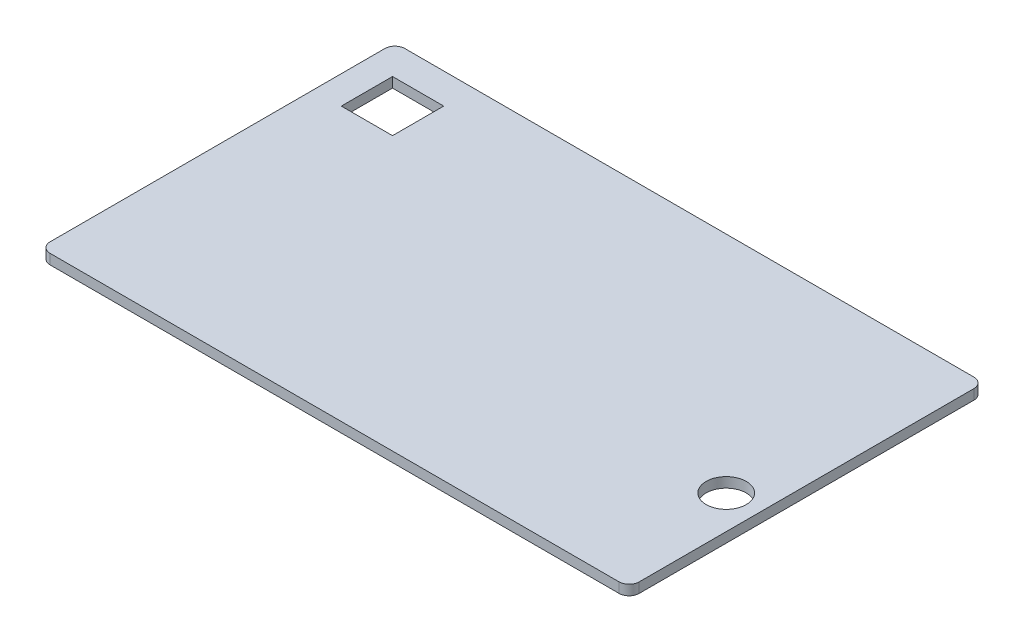
ISO-10303-21;
HEADER;
FILE_DESCRIPTION(('STEP AP214'),'2;1');
FILE_NAME('part.step','',(''),(''),'','','');
FILE_SCHEMA(('AUTOMOTIVE_DESIGN { 1 0 10303 214 1 1 1 1 }'));
ENDSEC;
DATA;
#1=APPLICATION_CONTEXT('core data for automotive mechanical design processes');
#2=APPLICATION_PROTOCOL_DEFINITION('international standard','automotive_design',2000,#1);
#3=PRODUCT_CONTEXT('',#1,'mechanical');
#4=PRODUCT('Part','Part','',(#3));
#5=PRODUCT_RELATED_PRODUCT_CATEGORY('part','',(#4));
#6=PRODUCT_DEFINITION_FORMATION('','',#4);
#7=PRODUCT_DEFINITION_CONTEXT('part definition',#1,'design');
#8=PRODUCT_DEFINITION('design','',#6,#7);
#9=PRODUCT_DEFINITION_SHAPE('','',#8);
#10=(LENGTH_UNIT() NAMED_UNIT(*) SI_UNIT(.MILLI.,.METRE.));
#11=(NAMED_UNIT(*) PLANE_ANGLE_UNIT() SI_UNIT($,.RADIAN.));
#12=(NAMED_UNIT(*) SI_UNIT($,.STERADIAN.) SOLID_ANGLE_UNIT());
#13=UNCERTAINTY_MEASURE_WITH_UNIT(LENGTH_MEASURE(1.E-05),#10,'distance_accuracy_value','');
#14=(GEOMETRIC_REPRESENTATION_CONTEXT(3) GLOBAL_UNCERTAINTY_ASSIGNED_CONTEXT((#13)) GLOBAL_UNIT_ASSIGNED_CONTEXT((#10,
#11,#12)) REPRESENTATION_CONTEXT('',''));
#15=CARTESIAN_POINT('',(0.,0.,0.));
#16=DIRECTION('',(0.,0.,1.));
#17=DIRECTION('',(1.,0.,0.));
#18=AXIS2_PLACEMENT_3D('',#15,#16,#17);
#19=CARTESIAN_POINT('',(88.,3.,53.));
#20=DIRECTION('',(-1.,0.,0.));
#21=DIRECTION('',(0.,0.,1.));
#22=AXIS2_PLACEMENT_3D('',#19,#20,#21);
#23=PLANE('',#22);
#24=DIRECTION('',(0.,0.,-1.));
#25=VECTOR('',#24,1.);
#26=CARTESIAN_POINT('',(88.,0.,53.));
#27=LINE('',#26,#25);
#28=CARTESIAN_POINT('',(88.,0.,50.));
#29=VERTEX_POINT('',#28);
#30=CARTESIAN_POINT('',(88.,0.,-50.));
#31=VERTEX_POINT('',#30);
#32=EDGE_CURVE('E184',#29,#31,#27,.T.);
#33=ORIENTED_EDGE('',*,*,#32,.T.);
#34=DIRECTION('',(0.,-1.,0.));
#35=VECTOR('',#34,1.);
#36=CARTESIAN_POINT('',(88.,3.,-50.));
#37=LINE('',#36,#35);
#38=CARTESIAN_POINT('',(88.,3.,-50.));
#39=VERTEX_POINT('',#38);
#40=EDGE_CURVE('E239',#31,#39,#37,.F.);
#41=ORIENTED_EDGE('',*,*,#40,.T.);
#42=DIRECTION('',(0.,0.,-1.));
#43=VECTOR('',#42,1.);
#44=CARTESIAN_POINT('',(88.,3.,53.));
#45=LINE('',#44,#43);
#46=CARTESIAN_POINT('',(88.,3.,50.));
#47=VERTEX_POINT('',#46);
#48=EDGE_CURVE('E185',#47,#39,#45,.T.);
#49=ORIENTED_EDGE('',*,*,#48,.F.);
#50=DIRECTION('',(0.,-1.,0.));
#51=VECTOR('',#50,1.);
#52=CARTESIAN_POINT('',(88.,3.,50.));
#53=LINE('',#52,#51);
#54=EDGE_CURVE('E235',#47,#29,#53,.T.);
#55=ORIENTED_EDGE('',*,*,#54,.T.);
#56=EDGE_LOOP('',(#33,#41,#49,#55));
#57=FACE_BOUND('',#56,.T.);
#58=ADVANCED_FACE('F38',(#57),#23,.F.);
#59=CARTESIAN_POINT('',(-88.,3.,-53.));
#60=DIRECTION('',(0.,0.,1.));
#61=DIRECTION('',(1.,0.,0.));
#62=AXIS2_PLACEMENT_3D('',#59,#60,#61);
#63=PLANE('',#62);
#64=DIRECTION('',(-1.,0.,0.));
#65=VECTOR('',#64,1.);
#66=CARTESIAN_POINT('',(-88.,3.,-53.));
#67=LINE('',#66,#65);
#68=CARTESIAN_POINT('',(85.,3.,-53.));
#69=VERTEX_POINT('',#68);
#70=CARTESIAN_POINT('',(-85.,3.,-53.));
#71=VERTEX_POINT('',#70);
#72=EDGE_CURVE('E189',#69,#71,#67,.T.);
#73=ORIENTED_EDGE('',*,*,#72,.F.);
#74=DIRECTION('',(0.,-1.,0.));
#75=VECTOR('',#74,1.);
#76=CARTESIAN_POINT('',(85.,3.,-53.));
#77=LINE('',#76,#75);
#78=CARTESIAN_POINT('',(85.,0.,-53.));
#79=VERTEX_POINT('',#78);
#80=EDGE_CURVE('E219',#69,#79,#77,.T.);
#81=ORIENTED_EDGE('',*,*,#80,.T.);
#82=DIRECTION('',(-1.,0.,0.));
#83=VECTOR('',#82,1.);
#84=CARTESIAN_POINT('',(-88.,0.,-53.));
#85=LINE('',#84,#83);
#86=CARTESIAN_POINT('',(-85.,0.,-53.));
#87=VERTEX_POINT('',#86);
#88=EDGE_CURVE('E206',#79,#87,#85,.T.);
#89=ORIENTED_EDGE('',*,*,#88,.T.);
#90=DIRECTION('',(0.,-1.,0.));
#91=VECTOR('',#90,1.);
#92=CARTESIAN_POINT('',(-85.,3.,-53.));
#93=LINE('',#92,#91);
#94=EDGE_CURVE('E202',#87,#71,#93,.F.);
#95=ORIENTED_EDGE('',*,*,#94,.T.);
#96=EDGE_LOOP('',(#73,#81,#89,#95));
#97=FACE_BOUND('',#96,.T.);
#98=ADVANCED_FACE('F294',(#97),#63,.F.);
#99=CARTESIAN_POINT('',(-88.,3.,53.));
#100=DIRECTION('',(1.,0.,0.));
#101=DIRECTION('',(0.,0.,-1.));
#102=AXIS2_PLACEMENT_3D('',#99,#100,#101);
#103=PLANE('',#102);
#104=DIRECTION('',(0.,0.,1.));
#105=VECTOR('',#104,1.);
#106=CARTESIAN_POINT('',(-88.,3.,53.));
#107=LINE('',#106,#105);
#108=CARTESIAN_POINT('',(-88.,3.,-50.));
#109=VERTEX_POINT('',#108);
#110=CARTESIAN_POINT('',(-88.,3.,50.));
#111=VERTEX_POINT('',#110);
#112=EDGE_CURVE('E194',#109,#111,#107,.T.);
#113=ORIENTED_EDGE('',*,*,#112,.F.);
#114=DIRECTION('',(0.,-1.,0.));
#115=VECTOR('',#114,1.);
#116=CARTESIAN_POINT('',(-88.,3.,-50.));
#117=LINE('',#116,#115);
#118=CARTESIAN_POINT('',(-88.,0.,-50.));
#119=VERTEX_POINT('',#118);
#120=EDGE_CURVE('E11',#109,#119,#117,.T.);
#121=ORIENTED_EDGE('',*,*,#120,.T.);
#122=DIRECTION('',(0.,0.,1.));
#123=VECTOR('',#122,1.);
#124=CARTESIAN_POINT('',(-88.,0.,53.));
#125=LINE('',#124,#123);
#126=CARTESIAN_POINT('',(-88.,0.,50.));
#127=VERTEX_POINT('',#126);
#128=EDGE_CURVE('E210',#119,#127,#125,.T.);
#129=ORIENTED_EDGE('',*,*,#128,.T.);
#130=DIRECTION('',(0.,-1.,0.));
#131=VECTOR('',#130,1.);
#132=CARTESIAN_POINT('',(-88.,3.,50.));
#133=LINE('',#132,#131);
#134=EDGE_CURVE('E47',#127,#111,#133,.F.);
#135=ORIENTED_EDGE('',*,*,#134,.T.);
#136=EDGE_LOOP('',(#113,#121,#129,#135));
#137=FACE_BOUND('',#136,.T.);
#138=ADVANCED_FACE('F264',(#137),#103,.F.);
#139=CARTESIAN_POINT('',(-88.,3.,53.));
#140=DIRECTION('',(0.,0.,-1.));
#141=DIRECTION('',(-1.,0.,0.));
#142=AXIS2_PLACEMENT_3D('',#139,#140,#141);
#143=PLANE('',#142);
#144=DIRECTION('',(1.,0.,0.));
#145=VECTOR('',#144,1.);
#146=CARTESIAN_POINT('',(-88.,0.,53.));
#147=LINE('',#146,#145);
#148=CARTESIAN_POINT('',(-85.,0.,53.));
#149=VERTEX_POINT('',#148);
#150=CARTESIAN_POINT('',(85.,0.,53.));
#151=VERTEX_POINT('',#150);
#152=EDGE_CURVE('E190',#149,#151,#147,.T.);
#153=ORIENTED_EDGE('',*,*,#152,.T.);
#154=DIRECTION('',(0.,-1.,0.));
#155=VECTOR('',#154,1.);
#156=CARTESIAN_POINT('',(85.,3.,53.));
#157=LINE('',#156,#155);
#158=CARTESIAN_POINT('',(85.,3.,53.));
#159=VERTEX_POINT('',#158);
#160=EDGE_CURVE('E258',#151,#159,#157,.F.);
#161=ORIENTED_EDGE('',*,*,#160,.T.);
#162=DIRECTION('',(1.,0.,0.));
#163=VECTOR('',#162,1.);
#164=CARTESIAN_POINT('',(-88.,3.,53.));
#165=LINE('',#164,#163);
#166=CARTESIAN_POINT('',(-85.,3.,53.));
#167=VERTEX_POINT('',#166);
#168=EDGE_CURVE('E198',#167,#159,#165,.T.);
#169=ORIENTED_EDGE('',*,*,#168,.F.);
#170=DIRECTION('',(0.,-1.,0.));
#171=VECTOR('',#170,1.);
#172=CARTESIAN_POINT('',(-85.,3.,53.));
#173=LINE('',#172,#171);
#174=EDGE_CURVE('E254',#167,#149,#173,.T.);
#175=ORIENTED_EDGE('',*,*,#174,.T.);
#176=EDGE_LOOP('',(#153,#161,#169,#175));
#177=FACE_BOUND('',#176,.T.);
#178=ADVANCED_FACE('F276',(#177),#143,.F.);
#179=CARTESIAN_POINT('',(0.,3.,0.));
#180=DIRECTION('',(0.,-1.,0.));
#181=DIRECTION('',(0.,0.,-1.));
#182=AXIS2_PLACEMENT_3D('',#179,#180,#181);
#183=PLANE('',#182);
#184=DIRECTION('',(-1.,0.,0.));
#185=VECTOR('',#184,1.);
#186=CARTESIAN_POINT('',(0.,3.,-28.6134016434082));
#187=LINE('',#186,#185);
#188=CARTESIAN_POINT('',(-64.3116391131463,3.,-28.6134016434082));
#189=VERTEX_POINT('',#188);
#190=CARTESIAN_POINT('',(-79.6116391131463,3.,-28.6134016434082));
#191=VERTEX_POINT('',#190);
#192=EDGE_CURVE('E168',#189,#191,#187,.T.);
#193=ORIENTED_EDGE('',*,*,#192,.T.);
#194=DIRECTION('',(0.,0.,-1.));
#195=VECTOR('',#194,1.);
#196=CARTESIAN_POINT('',(-79.6116391131463,3.,0.));
#197=LINE('',#196,#195);
#198=CARTESIAN_POINT('',(-79.6116391131463,3.,-43.9134016434082));
#199=VERTEX_POINT('',#198);
#200=EDGE_CURVE('E172',#191,#199,#197,.T.);
#201=ORIENTED_EDGE('',*,*,#200,.T.);
#202=DIRECTION('',(1.,0.,0.));
#203=VECTOR('',#202,1.);
#204=CARTESIAN_POINT('',(0.,3.,-43.9134016434082));
#205=LINE('',#204,#203);
#206=CARTESIAN_POINT('',(-64.3116391131463,3.,-43.9134016434082));
#207=VERTEX_POINT('',#206);
#208=EDGE_CURVE('E159',#199,#207,#205,.T.);
#209=ORIENTED_EDGE('',*,*,#208,.T.);
#210=DIRECTION('',(0.,0.,1.));
#211=VECTOR('',#210,1.);
#212=CARTESIAN_POINT('',(-64.3116391131463,3.,0.));
#213=LINE('',#212,#211);
#214=EDGE_CURVE('E134',#207,#189,#213,.T.);
#215=ORIENTED_EDGE('',*,*,#214,.T.);
#216=EDGE_LOOP('',(#193,#201,#209,#215));
#217=FACE_BOUND('',#216,.T.);
#218=CARTESIAN_POINT('',(78.,3.,14.));
#219=DIRECTION('',(0.,-1.,0.));
#220=DIRECTION('',(0.,0.,-1.));
#221=AXIS2_PLACEMENT_3D('',#218,#219,#220);
#222=CIRCLE('',#221,6.);
#223=CARTESIAN_POINT('',(78.,3.,8.));
#224=VERTEX_POINT('',#223);
#225=EDGE_CURVE('E180',#224,#224,#222,.T.);
#226=ORIENTED_EDGE('',*,*,#225,.T.);
#227=EDGE_LOOP('',(#226));
#228=FACE_BOUND('',#227,.T.);
#229=ORIENTED_EDGE('',*,*,#48,.T.);
#230=CARTESIAN_POINT('',(85.,3.,-50.));
#231=DIRECTION('',(0.,-1.,0.));
#232=DIRECTION('',(0.,0.,-1.));
#233=AXIS2_PLACEMENT_3D('',#230,#231,#232);
#234=CIRCLE('',#233,3.);
#235=EDGE_CURVE('E251',#39,#69,#234,.F.);
#236=ORIENTED_EDGE('',*,*,#235,.T.);
#237=ORIENTED_EDGE('',*,*,#72,.T.);
#238=CARTESIAN_POINT('',(-85.,3.,-50.));
#239=DIRECTION('',(0.,-1.,0.));
#240=DIRECTION('',(0.,0.,-1.));
#241=AXIS2_PLACEMENT_3D('',#238,#239,#240);
#242=CIRCLE('',#241,3.);
#243=EDGE_CURVE('E245',#71,#109,#242,.F.);
#244=ORIENTED_EDGE('',*,*,#243,.T.);
#245=ORIENTED_EDGE('',*,*,#112,.T.);
#246=CARTESIAN_POINT('',(-85.,3.,50.));
#247=DIRECTION('',(0.,-1.,0.));
#248=DIRECTION('',(0.,0.,-1.));
#249=AXIS2_PLACEMENT_3D('',#246,#247,#248);
#250=CIRCLE('',#249,3.);
#251=EDGE_CURVE('E242',#111,#167,#250,.F.);
#252=ORIENTED_EDGE('',*,*,#251,.T.);
#253=ORIENTED_EDGE('',*,*,#168,.T.);
#254=CARTESIAN_POINT('',(85.,3.,50.));
#255=DIRECTION('',(0.,-1.,0.));
#256=DIRECTION('',(0.,0.,-1.));
#257=AXIS2_PLACEMENT_3D('',#254,#255,#256);
#258=CIRCLE('',#257,3.);
#259=EDGE_CURVE('E248',#159,#47,#258,.F.);
#260=ORIENTED_EDGE('',*,*,#259,.T.);
#261=EDGE_LOOP('',(#229,#236,#237,#244,#245,#252,#253,#260));
#262=FACE_BOUND('',#261,.T.);
#263=ADVANCED_FACE('F270',(#217,#228,#262),#183,.F.);
#264=CARTESIAN_POINT('',(0.,0.,0.));
#265=DIRECTION('',(0.,-1.,0.));
#266=DIRECTION('',(0.,0.,-1.));
#267=AXIS2_PLACEMENT_3D('',#264,#265,#266);
#268=PLANE('',#267);
#269=DIRECTION('',(0.,0.,-1.));
#270=VECTOR('',#269,1.);
#271=CARTESIAN_POINT('',(-79.6116391131463,0.,-43.9134016434082));
#272=LINE('',#271,#270);
#273=CARTESIAN_POINT('',(-79.6116391131463,0.,-28.6134016434082));
#274=VERTEX_POINT('',#273);
#275=CARTESIAN_POINT('',(-79.6116391131463,0.,-43.9134016434082));
#276=VERTEX_POINT('',#275);
#277=EDGE_CURVE('E62',#274,#276,#272,.T.);
#278=ORIENTED_EDGE('',*,*,#277,.F.);
#279=DIRECTION('',(-1.,0.,0.));
#280=VECTOR('',#279,1.);
#281=CARTESIAN_POINT('',(-79.6116391131463,0.,-28.6134016434082));
#282=LINE('',#281,#280);
#283=CARTESIAN_POINT('',(-64.3116391131463,0.,-28.6134016434082));
#284=VERTEX_POINT('',#283);
#285=EDGE_CURVE('E149',#284,#274,#282,.T.);
#286=ORIENTED_EDGE('',*,*,#285,.F.);
#287=DIRECTION('',(0.,0.,1.));
#288=VECTOR('',#287,1.);
#289=CARTESIAN_POINT('',(-64.3116391131463,0.,-43.9134016434082));
#290=LINE('',#289,#288);
#291=CARTESIAN_POINT('',(-64.3116391131463,0.,-43.9134016434082));
#292=VERTEX_POINT('',#291);
#293=EDGE_CURVE('E131',#292,#284,#290,.T.);
#294=ORIENTED_EDGE('',*,*,#293,.F.);
#295=DIRECTION('',(1.,0.,0.));
#296=VECTOR('',#295,1.);
#297=CARTESIAN_POINT('',(-79.6116391131463,0.,-43.9134016434082));
#298=LINE('',#297,#296);
#299=EDGE_CURVE('E141',#276,#292,#298,.T.);
#300=ORIENTED_EDGE('',*,*,#299,.F.);
#301=EDGE_LOOP('',(#278,#286,#294,#300));
#302=FACE_BOUND('',#301,.T.);
#303=CARTESIAN_POINT('',(78.,0.,14.));
#304=DIRECTION('',(0.,-1.,0.));
#305=DIRECTION('',(0.,0.,-1.));
#306=AXIS2_PLACEMENT_3D('',#303,#304,#305);
#307=CIRCLE('',#306,6.);
#308=CARTESIAN_POINT('',(78.,0.,8.));
#309=VERTEX_POINT('',#308);
#310=EDGE_CURVE('E176',#309,#309,#307,.T.);
#311=ORIENTED_EDGE('',*,*,#310,.F.);
#312=EDGE_LOOP('',(#311));
#313=FACE_BOUND('',#312,.T.);
#314=ORIENTED_EDGE('',*,*,#88,.F.);
#315=CARTESIAN_POINT('',(85.,0.,-50.));
#316=DIRECTION('',(0.,-1.,0.));
#317=DIRECTION('',(0.,0.,-1.));
#318=AXIS2_PLACEMENT_3D('',#315,#316,#317);
#319=CIRCLE('',#318,3.);
#320=EDGE_CURVE('E232',#79,#31,#319,.T.);
#321=ORIENTED_EDGE('',*,*,#320,.T.);
#322=ORIENTED_EDGE('',*,*,#32,.F.);
#323=CARTESIAN_POINT('',(85.,0.,50.));
#324=DIRECTION('',(0.,-1.,0.));
#325=DIRECTION('',(0.,0.,-1.));
#326=AXIS2_PLACEMENT_3D('',#323,#324,#325);
#327=CIRCLE('',#326,3.);
#328=EDGE_CURVE('E229',#29,#151,#327,.T.);
#329=ORIENTED_EDGE('',*,*,#328,.T.);
#330=ORIENTED_EDGE('',*,*,#152,.F.);
#331=CARTESIAN_POINT('',(-85.,0.,50.));
#332=DIRECTION('',(0.,-1.,0.));
#333=DIRECTION('',(0.,0.,-1.));
#334=AXIS2_PLACEMENT_3D('',#331,#332,#333);
#335=CIRCLE('',#334,3.);
#336=EDGE_CURVE('E223',#149,#127,#335,.T.);
#337=ORIENTED_EDGE('',*,*,#336,.T.);
#338=ORIENTED_EDGE('',*,*,#128,.F.);
#339=CARTESIAN_POINT('',(-85.,0.,-50.));
#340=DIRECTION('',(0.,-1.,0.));
#341=DIRECTION('',(0.,0.,-1.));
#342=AXIS2_PLACEMENT_3D('',#339,#340,#341);
#343=CIRCLE('',#342,3.);
#344=EDGE_CURVE('E226',#119,#87,#343,.T.);
#345=ORIENTED_EDGE('',*,*,#344,.T.);
#346=EDGE_LOOP('',(#314,#321,#322,#329,#330,#337,#338,#345));
#347=FACE_BOUND('',#346,.T.);
#348=ADVANCED_FACE('F146',(#302,#313,#347),#268,.T.);
#349=CARTESIAN_POINT('',(85.,3.,-50.));
#350=DIRECTION('',(0.,-1.,0.));
#351=DIRECTION('',(0.,0.,-1.));
#352=AXIS2_PLACEMENT_3D('',#349,#350,#351);
#353=CYLINDRICAL_SURFACE('',#352,3.);
#354=ORIENTED_EDGE('',*,*,#235,.F.);
#355=ORIENTED_EDGE('',*,*,#40,.F.);
#356=ORIENTED_EDGE('',*,*,#320,.F.);
#357=ORIENTED_EDGE('',*,*,#80,.F.);
#358=EDGE_LOOP('',(#354,#355,#356,#357));
#359=FACE_BOUND('',#358,.T.);
#360=ADVANCED_FACE('F292',(#359),#353,.T.);
#361=CARTESIAN_POINT('',(85.,3.,50.));
#362=DIRECTION('',(0.,-1.,0.));
#363=DIRECTION('',(0.,0.,-1.));
#364=AXIS2_PLACEMENT_3D('',#361,#362,#363);
#365=CYLINDRICAL_SURFACE('',#364,3.);
#366=ORIENTED_EDGE('',*,*,#259,.F.);
#367=ORIENTED_EDGE('',*,*,#160,.F.);
#368=ORIENTED_EDGE('',*,*,#328,.F.);
#369=ORIENTED_EDGE('',*,*,#54,.F.);
#370=EDGE_LOOP('',(#366,#367,#368,#369));
#371=FACE_BOUND('',#370,.T.);
#372=ADVANCED_FACE('F284',(#371),#365,.T.);
#373=CARTESIAN_POINT('',(-85.,3.,-50.));
#374=DIRECTION('',(0.,-1.,0.));
#375=DIRECTION('',(0.,0.,-1.));
#376=AXIS2_PLACEMENT_3D('',#373,#374,#375);
#377=CYLINDRICAL_SURFACE('',#376,3.);
#378=ORIENTED_EDGE('',*,*,#243,.F.);
#379=ORIENTED_EDGE('',*,*,#94,.F.);
#380=ORIENTED_EDGE('',*,*,#344,.F.);
#381=ORIENTED_EDGE('',*,*,#120,.F.);
#382=EDGE_LOOP('',(#378,#379,#380,#381));
#383=FACE_BOUND('',#382,.T.);
#384=ADVANCED_FACE('F297',(#383),#377,.T.);
#385=CARTESIAN_POINT('',(-85.,3.,50.));
#386=DIRECTION('',(0.,-1.,0.));
#387=DIRECTION('',(0.,0.,-1.));
#388=AXIS2_PLACEMENT_3D('',#385,#386,#387);
#389=CYLINDRICAL_SURFACE('',#388,3.);
#390=ORIENTED_EDGE('',*,*,#251,.F.);
#391=ORIENTED_EDGE('',*,*,#134,.F.);
#392=ORIENTED_EDGE('',*,*,#336,.F.);
#393=ORIENTED_EDGE('',*,*,#174,.F.);
#394=EDGE_LOOP('',(#390,#391,#392,#393));
#395=FACE_BOUND('',#394,.T.);
#396=ADVANCED_FACE('F40',(#395),#389,.T.);
#397=CARTESIAN_POINT('',(78.,10.,14.));
#398=DIRECTION('',(0.,-1.,0.));
#399=DIRECTION('',(0.,0.,-1.));
#400=AXIS2_PLACEMENT_3D('',#397,#398,#399);
#401=CYLINDRICAL_SURFACE('',#400,6.);
#402=ORIENTED_EDGE('',*,*,#310,.T.);
#403=EDGE_LOOP('',(#402));
#404=FACE_BOUND('',#403,.T.);
#405=ORIENTED_EDGE('',*,*,#225,.F.);
#406=EDGE_LOOP('',(#405));
#407=FACE_BOUND('',#406,.T.);
#408=ADVANCED_FACE('F303',(#404,#407),#401,.F.);
#409=CARTESIAN_POINT('',(-79.6116391131463,10.,-43.9134016434082));
#410=DIRECTION('',(-1.,0.,0.));
#411=DIRECTION('',(0.,0.,1.));
#412=AXIS2_PLACEMENT_3D('',#409,#410,#411);
#413=PLANE('',#412);
#414=DIRECTION('',(0.,-1.,0.));
#415=VECTOR('',#414,1.);
#416=CARTESIAN_POINT('',(-79.6116391131463,10.,-28.6134016434082));
#417=LINE('',#416,#415);
#418=EDGE_CURVE('E156',#191,#274,#417,.T.);
#419=ORIENTED_EDGE('',*,*,#418,.T.);
#420=ORIENTED_EDGE('',*,*,#277,.T.);
#421=DIRECTION('',(0.,-1.,0.));
#422=VECTOR('',#421,1.);
#423=CARTESIAN_POINT('',(-79.6116391131463,10.,-43.9134016434082));
#424=LINE('',#423,#422);
#425=EDGE_CURVE('E138',#199,#276,#424,.T.);
#426=ORIENTED_EDGE('',*,*,#425,.F.);
#427=ORIENTED_EDGE('',*,*,#200,.F.);
#428=EDGE_LOOP('',(#419,#420,#426,#427));
#429=FACE_BOUND('',#428,.T.);
#430=ADVANCED_FACE('F372',(#429),#413,.F.);
#431=CARTESIAN_POINT('',(-79.6116391131463,10.,-28.6134016434082));
#432=DIRECTION('',(0.,0.,1.));
#433=DIRECTION('',(1.,0.,0.));
#434=AXIS2_PLACEMENT_3D('',#431,#432,#433);
#435=PLANE('',#434);
#436=DIRECTION('',(0.,-1.,0.));
#437=VECTOR('',#436,1.);
#438=CARTESIAN_POINT('',(-64.3116391131463,10.,-28.6134016434082));
#439=LINE('',#438,#437);
#440=EDGE_CURVE('E137',#189,#284,#439,.T.);
#441=ORIENTED_EDGE('',*,*,#440,.T.);
#442=ORIENTED_EDGE('',*,*,#285,.T.);
#443=ORIENTED_EDGE('',*,*,#418,.F.);
#444=ORIENTED_EDGE('',*,*,#192,.F.);
#445=EDGE_LOOP('',(#441,#442,#443,#444));
#446=FACE_BOUND('',#445,.T.);
#447=ADVANCED_FACE('F379',(#446),#435,.F.);
#448=CARTESIAN_POINT('',(-64.3116391131463,10.,-43.9134016434082));
#449=DIRECTION('',(1.,0.,0.));
#450=DIRECTION('',(0.,0.,-1.));
#451=AXIS2_PLACEMENT_3D('',#448,#449,#450);
#452=PLANE('',#451);
#453=DIRECTION('',(0.,-1.,0.));
#454=VECTOR('',#453,1.);
#455=CARTESIAN_POINT('',(-64.3116391131463,10.,-43.9134016434082));
#456=LINE('',#455,#454);
#457=EDGE_CURVE('E54',#207,#292,#456,.T.);
#458=ORIENTED_EDGE('',*,*,#457,.T.);
#459=ORIENTED_EDGE('',*,*,#293,.T.);
#460=ORIENTED_EDGE('',*,*,#440,.F.);
#461=ORIENTED_EDGE('',*,*,#214,.F.);
#462=EDGE_LOOP('',(#458,#459,#460,#461));
#463=FACE_BOUND('',#462,.T.);
#464=ADVANCED_FACE('F128',(#463),#452,.F.);
#465=CARTESIAN_POINT('',(-79.6116391131463,10.,-43.9134016434082));
#466=DIRECTION('',(0.,0.,-1.));
#467=DIRECTION('',(-1.,0.,0.));
#468=AXIS2_PLACEMENT_3D('',#465,#466,#467);
#469=PLANE('',#468);
#470=ORIENTED_EDGE('',*,*,#425,.T.);
#471=ORIENTED_EDGE('',*,*,#299,.T.);
#472=ORIENTED_EDGE('',*,*,#457,.F.);
#473=ORIENTED_EDGE('',*,*,#208,.F.);
#474=EDGE_LOOP('',(#470,#471,#472,#473));
#475=FACE_BOUND('',#474,.T.);
#476=ADVANCED_FACE('F142',(#475),#469,.F.);
#477=CLOSED_SHELL('',(#58,#98,#138,#178,#263,#348,#360,#372,#384,#396,#408,#430,#447,#464,#476));
#478=MANIFOLD_SOLID_BREP('B2',#477);
#479=ADVANCED_BREP_SHAPE_REPRESENTATION('',(#18,#478),#14);
#480=SHAPE_DEFINITION_REPRESENTATION(#9,#479);
ENDSEC;
END-ISO-10303-21;
